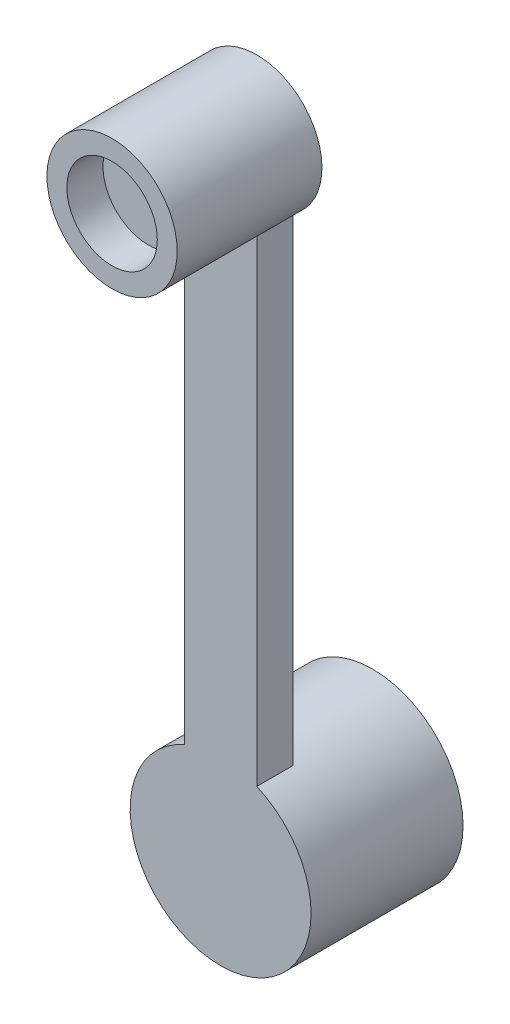
ISO-10303-21;
HEADER;
FILE_DESCRIPTION(('STEP AP214'),'2;1');
FILE_NAME('part.step','',(''),(''),'','','');
FILE_SCHEMA(('AUTOMOTIVE_DESIGN { 1 0 10303 214 1 1 1 1 }'));
ENDSEC;
DATA;
#1=APPLICATION_CONTEXT('core data for automotive mechanical design processes');
#2=APPLICATION_PROTOCOL_DEFINITION('international standard','automotive_design',2000,#1);
#3=PRODUCT_CONTEXT('',#1,'mechanical');
#4=PRODUCT('Part','Part','',(#3));
#5=PRODUCT_RELATED_PRODUCT_CATEGORY('part','',(#4));
#6=PRODUCT_DEFINITION_FORMATION('','',#4);
#7=PRODUCT_DEFINITION_CONTEXT('part definition',#1,'design');
#8=PRODUCT_DEFINITION('design','',#6,#7);
#9=PRODUCT_DEFINITION_SHAPE('','',#8);
#10=(LENGTH_UNIT() NAMED_UNIT(*) SI_UNIT(.MILLI.,.METRE.));
#11=(NAMED_UNIT(*) PLANE_ANGLE_UNIT() SI_UNIT($,.RADIAN.));
#12=(NAMED_UNIT(*) SI_UNIT($,.STERADIAN.) SOLID_ANGLE_UNIT());
#13=UNCERTAINTY_MEASURE_WITH_UNIT(LENGTH_MEASURE(1.E-05),#10,'distance_accuracy_value','');
#14=(GEOMETRIC_REPRESENTATION_CONTEXT(3) GLOBAL_UNCERTAINTY_ASSIGNED_CONTEXT((#13)) GLOBAL_UNIT_ASSIGNED_CONTEXT((#10,
#11,#12)) REPRESENTATION_CONTEXT('',''));
#15=CARTESIAN_POINT('',(0.,0.,0.));
#16=DIRECTION('',(0.,0.,1.));
#17=DIRECTION('',(1.,0.,0.));
#18=AXIS2_PLACEMENT_3D('',#15,#16,#17);
#19=CARTESIAN_POINT('',(1.,0.,1.));
#20=DIRECTION('',(-1.,0.,0.));
#21=DIRECTION('',(0.,0.,1.));
#22=AXIS2_PLACEMENT_3D('',#19,#20,#21);
#23=PLANE('',#22);
#24=DIRECTION('',(0.,1.,0.));
#25=VECTOR('',#24,1.);
#26=CARTESIAN_POINT('',(1.,0.,1.));
#27=LINE('',#26,#25);
#28=CARTESIAN_POINT('',(1.,2.29128784747792,1.));
#29=VERTEX_POINT('',#28);
#30=CARTESIAN_POINT('',(1.,15.5033370452904,1.));
#31=VERTEX_POINT('',#30);
#32=EDGE_CURVE('E84',#29,#31,#27,.T.);
#33=ORIENTED_EDGE('',*,*,#32,.F.);
#34=DIRECTION('',(0.,0.,1.));
#35=VECTOR('',#34,1.);
#36=CARTESIAN_POINT('',(1.,2.29128784747792,-3.2));
#37=LINE('',#36,#35);
#38=CARTESIAN_POINT('',(1.,2.29128784747792,0.));
#39=VERTEX_POINT('',#38);
#40=EDGE_CURVE('E72',#29,#39,#37,.F.);
#41=ORIENTED_EDGE('',*,*,#40,.T.);
#42=DIRECTION('',(0.,1.,0.));
#43=VECTOR('',#42,1.);
#44=CARTESIAN_POINT('',(1.,0.,0.));
#45=LINE('',#44,#43);
#46=CARTESIAN_POINT('',(1.,15.5033370452904,0.));
#47=VERTEX_POINT('',#46);
#48=EDGE_CURVE('E96',#39,#47,#45,.T.);
#49=ORIENTED_EDGE('',*,*,#48,.T.);
#50=DIRECTION('',(0.,0.,-1.));
#51=VECTOR('',#50,1.);
#52=CARTESIAN_POINT('',(1.,15.5033370452904,4.));
#53=LINE('',#52,#51);
#54=EDGE_CURVE('E91',#31,#47,#53,.T.);
#55=ORIENTED_EDGE('',*,*,#54,.F.);
#56=EDGE_LOOP('',(#33,#41,#49,#55));
#57=FACE_BOUND('',#56,.T.);
#58=ADVANCED_FACE('F34',(#57),#23,.F.);
#59=CARTESIAN_POINT('',(-1.,0.,1.));
#60=DIRECTION('',(1.,0.,0.));
#61=DIRECTION('',(0.,0.,-1.));
#62=AXIS2_PLACEMENT_3D('',#59,#60,#61);
#63=PLANE('',#62);
#64=DIRECTION('',(0.,-1.,0.));
#65=VECTOR('',#64,1.);
#66=CARTESIAN_POINT('',(-1.,0.,0.));
#67=LINE('',#66,#65);
#68=CARTESIAN_POINT('',(-1.,15.5033370452904,0.));
#69=VERTEX_POINT('',#68);
#70=CARTESIAN_POINT('',(-1.,2.29128784747792,0.));
#71=VERTEX_POINT('',#70);
#72=EDGE_CURVE('E92',#69,#71,#67,.T.);
#73=ORIENTED_EDGE('',*,*,#72,.T.);
#74=DIRECTION('',(0.,0.,1.));
#75=VECTOR('',#74,1.);
#76=CARTESIAN_POINT('',(-1.,2.29128784747792,-3.2));
#77=LINE('',#76,#75);
#78=CARTESIAN_POINT('',(-1.,2.29128784747792,1.));
#79=VERTEX_POINT('',#78);
#80=EDGE_CURVE('E48',#71,#79,#77,.T.);
#81=ORIENTED_EDGE('',*,*,#80,.T.);
#82=DIRECTION('',(0.,-1.,0.));
#83=VECTOR('',#82,1.);
#84=CARTESIAN_POINT('',(-1.,0.,1.));
#85=LINE('',#84,#83);
#86=CARTESIAN_POINT('',(-1.,15.5033370452904,1.));
#87=VERTEX_POINT('',#86);
#88=EDGE_CURVE('E41',#87,#79,#85,.T.);
#89=ORIENTED_EDGE('',*,*,#88,.F.);
#90=DIRECTION('',(0.,0.,-1.));
#91=VECTOR('',#90,1.);
#92=CARTESIAN_POINT('',(-1.,15.5033370452904,4.));
#93=LINE('',#92,#91);
#94=EDGE_CURVE('E55',#69,#87,#93,.F.);
#95=ORIENTED_EDGE('',*,*,#94,.F.);
#96=EDGE_LOOP('',(#73,#81,#89,#95));
#97=FACE_BOUND('',#96,.T.);
#98=ADVANCED_FACE('F147',(#97),#63,.F.);
#99=CARTESIAN_POINT('',(0.,0.,1.));
#100=DIRECTION('',(0.,0.,1.));
#101=DIRECTION('',(1.,0.,0.));
#102=AXIS2_PLACEMENT_3D('',#99,#100,#101);
#103=PLANE('',#102);
#104=CARTESIAN_POINT('',(0.,0.,1.));
#105=DIRECTION('',(0.,0.,1.));
#106=DIRECTION('',(1.,0.,0.));
#107=AXIS2_PLACEMENT_3D('',#104,#105,#106);
#108=CIRCLE('',#107,2.5);
#109=EDGE_CURVE('E75',#79,#29,#108,.T.);
#110=ORIENTED_EDGE('',*,*,#109,.T.);
#111=ORIENTED_EDGE('',*,*,#32,.T.);
#112=CARTESIAN_POINT('',(0.,17.,1.));
#113=DIRECTION('',(0.,0.,1.));
#114=DIRECTION('',(1.,0.,0.));
#115=AXIS2_PLACEMENT_3D('',#112,#113,#114);
#116=CIRCLE('',#115,1.8);
#117=EDGE_CURVE('E101',#31,#87,#116,.F.);
#118=ORIENTED_EDGE('',*,*,#117,.T.);
#119=ORIENTED_EDGE('',*,*,#88,.T.);
#120=EDGE_LOOP('',(#110,#111,#118,#119));
#121=FACE_BOUND('',#120,.T.);
#122=ADVANCED_FACE('F83',(#121),#103,.T.);
#123=CARTESIAN_POINT('',(0.,0.,0.));
#124=DIRECTION('',(0.,0.,1.));
#125=DIRECTION('',(1.,0.,0.));
#126=AXIS2_PLACEMENT_3D('',#123,#124,#125);
#127=PLANE('',#126);
#128=ORIENTED_EDGE('',*,*,#48,.F.);
#129=CARTESIAN_POINT('',(0.,0.,0.));
#130=DIRECTION('',(0.,0.,1.));
#131=DIRECTION('',(1.,0.,0.));
#132=AXIS2_PLACEMENT_3D('',#129,#130,#131);
#133=CIRCLE('',#132,2.5);
#134=EDGE_CURVE('E11',#39,#71,#133,.T.);
#135=ORIENTED_EDGE('',*,*,#134,.T.);
#136=ORIENTED_EDGE('',*,*,#72,.F.);
#137=CARTESIAN_POINT('',(0.,17.,0.));
#138=DIRECTION('',(0.,0.,1.));
#139=DIRECTION('',(1.,0.,0.));
#140=AXIS2_PLACEMENT_3D('',#137,#138,#139);
#141=CIRCLE('',#140,1.8);
#142=EDGE_CURVE('E105',#47,#69,#141,.T.);
#143=ORIENTED_EDGE('',*,*,#142,.F.);
#144=EDGE_LOOP('',(#128,#135,#136,#143));
#145=FACE_BOUND('',#144,.T.);
#146=ADVANCED_FACE('F155',(#145),#127,.F.);
#147=CARTESIAN_POINT('',(0.,17.,4.));
#148=DIRECTION('',(0.,0.,-1.));
#149=DIRECTION('',(-1.,0.,0.));
#150=AXIS2_PLACEMENT_3D('',#147,#148,#149);
#151=CYLINDRICAL_SURFACE('',#150,1.8);
#152=CARTESIAN_POINT('',(0.,17.,4.));
#153=DIRECTION('',(0.,0.,1.));
#154=DIRECTION('',(1.,0.,0.));
#155=AXIS2_PLACEMENT_3D('',#152,#153,#154);
#156=CIRCLE('',#155,1.8);
#157=CARTESIAN_POINT('',(1.8,17.,4.));
#158=VERTEX_POINT('',#157);
#159=EDGE_CURVE('E102',#158,#158,#156,.T.);
#160=ORIENTED_EDGE('',*,*,#159,.F.);
#161=EDGE_LOOP('',(#160));
#162=FACE_BOUND('',#161,.T.);
#163=ORIENTED_EDGE('',*,*,#117,.F.);
#164=ORIENTED_EDGE('',*,*,#54,.T.);
#165=ORIENTED_EDGE('',*,*,#142,.T.);
#166=ORIENTED_EDGE('',*,*,#94,.T.);
#167=EDGE_LOOP('',(#163,#164,#165,#166));
#168=FACE_BOUND('',#167,.T.);
#169=ADVANCED_FACE('F159',(#162,#168),#151,.T.);
#170=CARTESIAN_POINT('',(0.,17.,4.));
#171=DIRECTION('',(0.,0.,1.));
#172=DIRECTION('',(1.,0.,0.));
#173=AXIS2_PLACEMENT_3D('',#170,#171,#172);
#174=PLANE('',#173);
#175=CARTESIAN_POINT('',(0.,17.,4.));
#176=DIRECTION('',(0.,0.,1.));
#177=DIRECTION('',(1.,0.,0.));
#178=AXIS2_PLACEMENT_3D('',#175,#176,#177);
#179=CIRCLE('',#178,1.25);
#180=CARTESIAN_POINT('',(1.25,17.,4.));
#181=VERTEX_POINT('',#180);
#182=EDGE_CURVE('E79',#181,#181,#179,.T.);
#183=ORIENTED_EDGE('',*,*,#182,.F.);
#184=EDGE_LOOP('',(#183));
#185=FACE_BOUND('',#184,.T.);
#186=ORIENTED_EDGE('',*,*,#159,.T.);
#187=EDGE_LOOP('',(#186));
#188=FACE_BOUND('',#187,.T.);
#189=ADVANCED_FACE('F164',(#185,#188),#174,.T.);
#190=CARTESIAN_POINT('',(0.,17.,3.));
#191=DIRECTION('',(0.,0.,1.));
#192=DIRECTION('',(1.,0.,0.));
#193=AXIS2_PLACEMENT_3D('',#190,#191,#192);
#194=CYLINDRICAL_SURFACE('',#193,1.25);
#195=CARTESIAN_POINT('',(0.,17.,3.));
#196=DIRECTION('',(0.,0.,1.));
#197=DIRECTION('',(1.,0.,0.));
#198=AXIS2_PLACEMENT_3D('',#195,#196,#197);
#199=CIRCLE('',#198,1.25);
#200=CARTESIAN_POINT('',(1.25,17.,3.));
#201=VERTEX_POINT('',#200);
#202=EDGE_CURVE('E107',#201,#201,#199,.T.);
#203=ORIENTED_EDGE('',*,*,#202,.F.);
#204=EDGE_LOOP('',(#203));
#205=FACE_BOUND('',#204,.T.);
#206=ORIENTED_EDGE('',*,*,#182,.T.);
#207=EDGE_LOOP('',(#206));
#208=FACE_BOUND('',#207,.T.);
#209=ADVANCED_FACE('F143',(#205,#208),#194,.F.);
#210=CARTESIAN_POINT('',(0.,17.,3.));
#211=DIRECTION('',(0.,0.,1.));
#212=DIRECTION('',(1.,0.,0.));
#213=AXIS2_PLACEMENT_3D('',#210,#211,#212);
#214=PLANE('',#213);
#215=ORIENTED_EDGE('',*,*,#202,.T.);
#216=EDGE_LOOP('',(#215));
#217=FACE_BOUND('',#216,.T.);
#218=ADVANCED_FACE('F138',(#217),#214,.T.);
#219=CARTESIAN_POINT('',(0.,0.,-3.2));
#220=DIRECTION('',(0.,0.,1.));
#221=DIRECTION('',(1.,0.,0.));
#222=AXIS2_PLACEMENT_3D('',#219,#220,#221);
#223=CYLINDRICAL_SURFACE('',#222,2.5);
#224=CARTESIAN_POINT('',(0.,0.,-3.2));
#225=DIRECTION('',(0.,0.,1.));
#226=DIRECTION('',(1.,0.,0.));
#227=AXIS2_PLACEMENT_3D('',#224,#225,#226);
#228=CIRCLE('',#227,2.5);
#229=CARTESIAN_POINT('',(2.5,0.,-3.2));
#230=VERTEX_POINT('',#229);
#231=EDGE_CURVE('E86',#230,#230,#228,.T.);
#232=ORIENTED_EDGE('',*,*,#231,.T.);
#233=EDGE_LOOP('',(#232));
#234=FACE_BOUND('',#233,.T.);
#235=ORIENTED_EDGE('',*,*,#40,.F.);
#236=ORIENTED_EDGE('',*,*,#109,.F.);
#237=ORIENTED_EDGE('',*,*,#80,.F.);
#238=ORIENTED_EDGE('',*,*,#134,.F.);
#239=EDGE_LOOP('',(#235,#236,#237,#238));
#240=FACE_BOUND('',#239,.T.);
#241=ADVANCED_FACE('F74',(#234,#240),#223,.T.);
#242=CARTESIAN_POINT('',(0.,0.,-3.2));
#243=DIRECTION('',(0.,0.,1.));
#244=DIRECTION('',(1.,0.,0.));
#245=AXIS2_PLACEMENT_3D('',#242,#243,#244);
#246=PLANE('',#245);
#247=CARTESIAN_POINT('',(0.,0.,-3.2));
#248=DIRECTION('',(0.,0.,-1.));
#249=DIRECTION('',(-1.,0.,0.));
#250=AXIS2_PLACEMENT_3D('',#247,#248,#249);
#251=CIRCLE('',#250,1.9);
#252=CARTESIAN_POINT('',(-1.9,0.,-3.2));
#253=VERTEX_POINT('',#252);
#254=EDGE_CURVE('E117',#253,#253,#251,.T.);
#255=ORIENTED_EDGE('',*,*,#254,.F.);
#256=EDGE_LOOP('',(#255));
#257=FACE_BOUND('',#256,.T.);
#258=ORIENTED_EDGE('',*,*,#231,.F.);
#259=EDGE_LOOP('',(#258));
#260=FACE_BOUND('',#259,.T.);
#261=ADVANCED_FACE('F128',(#257,#260),#246,.F.);
#262=CARTESIAN_POINT('',(0.,0.,0.799999999999999));
#263=DIRECTION('',(0.,0.,-1.));
#264=DIRECTION('',(-1.,0.,0.));
#265=AXIS2_PLACEMENT_3D('',#262,#263,#264);
#266=CYLINDRICAL_SURFACE('',#265,1.9);
#267=CARTESIAN_POINT('',(0.,0.,0.799999999999999));
#268=DIRECTION('',(0.,0.,-1.));
#269=DIRECTION('',(-1.,0.,0.));
#270=AXIS2_PLACEMENT_3D('',#267,#268,#269);
#271=CIRCLE('',#270,1.9);
#272=CARTESIAN_POINT('',(-1.9,0.,0.799999999999999));
#273=VERTEX_POINT('',#272);
#274=EDGE_CURVE('E87',#273,#273,#271,.T.);
#275=ORIENTED_EDGE('',*,*,#274,.F.);
#276=EDGE_LOOP('',(#275));
#277=FACE_BOUND('',#276,.T.);
#278=ORIENTED_EDGE('',*,*,#254,.T.);
#279=EDGE_LOOP('',(#278));
#280=FACE_BOUND('',#279,.T.);
#281=ADVANCED_FACE('F125',(#277,#280),#266,.F.);
#282=CARTESIAN_POINT('',(0.,0.,0.799999999999999));
#283=DIRECTION('',(0.,0.,-1.));
#284=DIRECTION('',(-1.,0.,0.));
#285=AXIS2_PLACEMENT_3D('',#282,#283,#284);
#286=PLANE('',#285);
#287=ORIENTED_EDGE('',*,*,#274,.T.);
#288=EDGE_LOOP('',(#287));
#289=FACE_BOUND('',#288,.T.);
#290=ADVANCED_FACE('F123',(#289),#286,.T.);
#291=CLOSED_SHELL('',(#58,#98,#122,#146,#169,#189,#209,#218,#241,#261,#281,#290));
#292=MANIFOLD_SOLID_BREP('B2',#291);
#293=ADVANCED_BREP_SHAPE_REPRESENTATION('',(#18,#292),#14);
#294=SHAPE_DEFINITION_REPRESENTATION(#9,#293);
ENDSEC;
END-ISO-10303-21;
